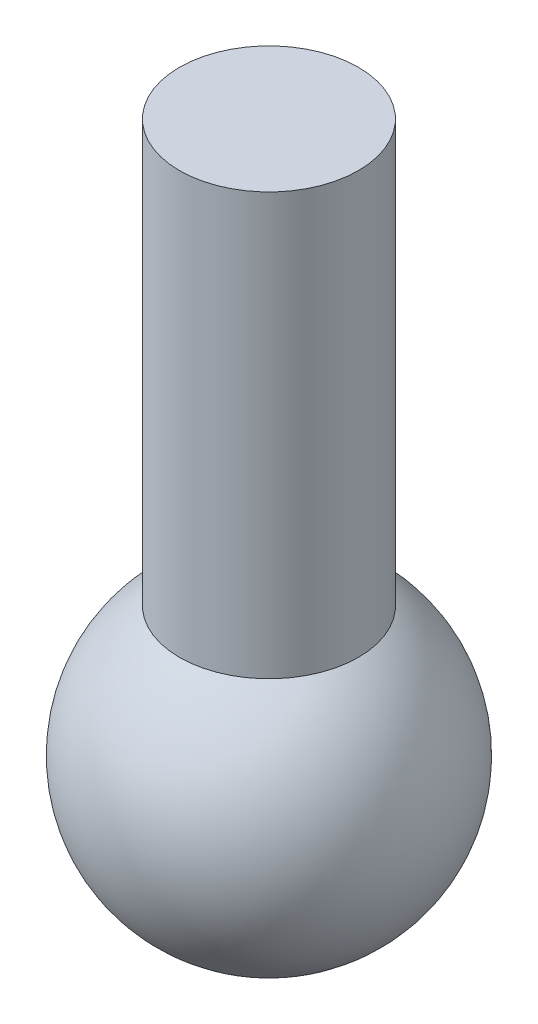
ISO-10303-21;
HEADER;
FILE_DESCRIPTION(('STEP AP214'),'2;1');
FILE_NAME('part.step','',(''),(''),'','','');
FILE_SCHEMA(('AUTOMOTIVE_DESIGN { 1 0 10303 214 1 1 1 1 }'));
ENDSEC;
DATA;
#1=APPLICATION_CONTEXT('core data for automotive mechanical design processes');
#2=APPLICATION_PROTOCOL_DEFINITION('international standard','automotive_design',2000,#1);
#3=PRODUCT_CONTEXT('',#1,'mechanical');
#4=PRODUCT('Part','Part','',(#3));
#5=PRODUCT_RELATED_PRODUCT_CATEGORY('part','',(#4));
#6=PRODUCT_DEFINITION_FORMATION('','',#4);
#7=PRODUCT_DEFINITION_CONTEXT('part definition',#1,'design');
#8=PRODUCT_DEFINITION('design','',#6,#7);
#9=PRODUCT_DEFINITION_SHAPE('','',#8);
#10=(LENGTH_UNIT() NAMED_UNIT(*) SI_UNIT(.MILLI.,.METRE.));
#11=(NAMED_UNIT(*) PLANE_ANGLE_UNIT() SI_UNIT($,.RADIAN.));
#12=(NAMED_UNIT(*) SI_UNIT($,.STERADIAN.) SOLID_ANGLE_UNIT());
#13=UNCERTAINTY_MEASURE_WITH_UNIT(LENGTH_MEASURE(1.E-05),#10,'distance_accuracy_value','');
#14=(GEOMETRIC_REPRESENTATION_CONTEXT(3) GLOBAL_UNCERTAINTY_ASSIGNED_CONTEXT((#13)) GLOBAL_UNIT_ASSIGNED_CONTEXT((#10,
#11,#12)) REPRESENTATION_CONTEXT('',''));
#15=CARTESIAN_POINT('',(0.,0.,0.));
#16=DIRECTION('',(0.,0.,1.));
#17=DIRECTION('',(1.,0.,0.));
#18=AXIS2_PLACEMENT_3D('',#15,#16,#17);
#19=CARTESIAN_POINT('',(0.,-2.201,0.));
#20=DIRECTION('',(0.,1.,0.));
#21=DIRECTION('',(0.,0.,1.));
#22=AXIS2_PLACEMENT_3D('',#19,#20,#21);
#23=CYLINDRICAL_SURFACE('',#22,1.25);
#24=CARTESIAN_POINT('',(0.,7.7,0.));
#25=DIRECTION('',(0.,1.,0.));
#26=DIRECTION('',(0.,0.,1.));
#27=AXIS2_PLACEMENT_3D('',#24,#25,#26);
#28=CIRCLE('',#27,1.25);
#29=CARTESIAN_POINT('',(0.,7.7,1.25));
#30=VERTEX_POINT('',#29);
#31=EDGE_CURVE('E10',#30,#30,#28,.T.);
#32=ORIENTED_EDGE('',*,*,#31,.F.);
#33=EDGE_LOOP('',(#32));
#34=FACE_BOUND('',#33,.T.);
#35=CARTESIAN_POINT('',(0.,1.81038669902317,0.));
#36=DIRECTION('',(0.,-1.,0.));
#37=DIRECTION('',(0.,0.,-1.));
#38=AXIS2_PLACEMENT_3D('',#35,#36,#37);
#39=CIRCLE('',#38,1.25);
#40=CARTESIAN_POINT('',(0.,1.81038669902317,-1.25));
#41=VERTEX_POINT('',#40);
#42=EDGE_CURVE('E38',#41,#41,#39,.F.);
#43=ORIENTED_EDGE('',*,*,#42,.T.);
#44=EDGE_LOOP('',(#43));
#45=FACE_BOUND('',#44,.T.);
#46=ADVANCED_FACE('F31',(#34,#45),#23,.T.);
#47=CARTESIAN_POINT('',(0.,7.7,0.));
#48=DIRECTION('',(0.,1.,0.));
#49=DIRECTION('',(0.,0.,1.));
#50=AXIS2_PLACEMENT_3D('',#47,#48,#49);
#51=PLANE('',#50);
#52=ORIENTED_EDGE('',*,*,#31,.T.);
#53=EDGE_LOOP('',(#52));
#54=FACE_BOUND('',#53,.T.);
#55=ADVANCED_FACE('F46',(#54),#51,.T.);
#56=CARTESIAN_POINT('',(0.,0.,0.));
#57=DIRECTION('',(0.,0.,-1.));
#58=DIRECTION('',(1.,0.,0.));
#59=AXIS2_PLACEMENT_3D('',#56,#57,#58);
#60=SPHERICAL_SURFACE('',#59,2.2);
#61=CARTESIAN_POINT('',(0.,0.,0.));
#62=DIRECTION('',(0.,-1.,0.));
#63=DIRECTION('',(0.,0.,-1.));
#64=AXIS2_PLACEMENT_3D('',#61,#62,#63);
#65=SPHERICAL_SURFACE('',#64,2.2);
#66=ORIENTED_EDGE('',*,*,#42,.F.);
#67=EDGE_LOOP('',(#66));
#68=FACE_BOUND('',#67,.T.);
#69=ADVANCED_FACE('F33',(#68),#65,.T.);
#70=CLOSED_SHELL('',(#46,#55,#69));
#71=MANIFOLD_SOLID_BREP('B2',#70);
#72=ADVANCED_BREP_SHAPE_REPRESENTATION('',(#18,#71),#14);
#73=SHAPE_DEFINITION_REPRESENTATION(#9,#72);
ENDSEC;
END-ISO-10303-21;
